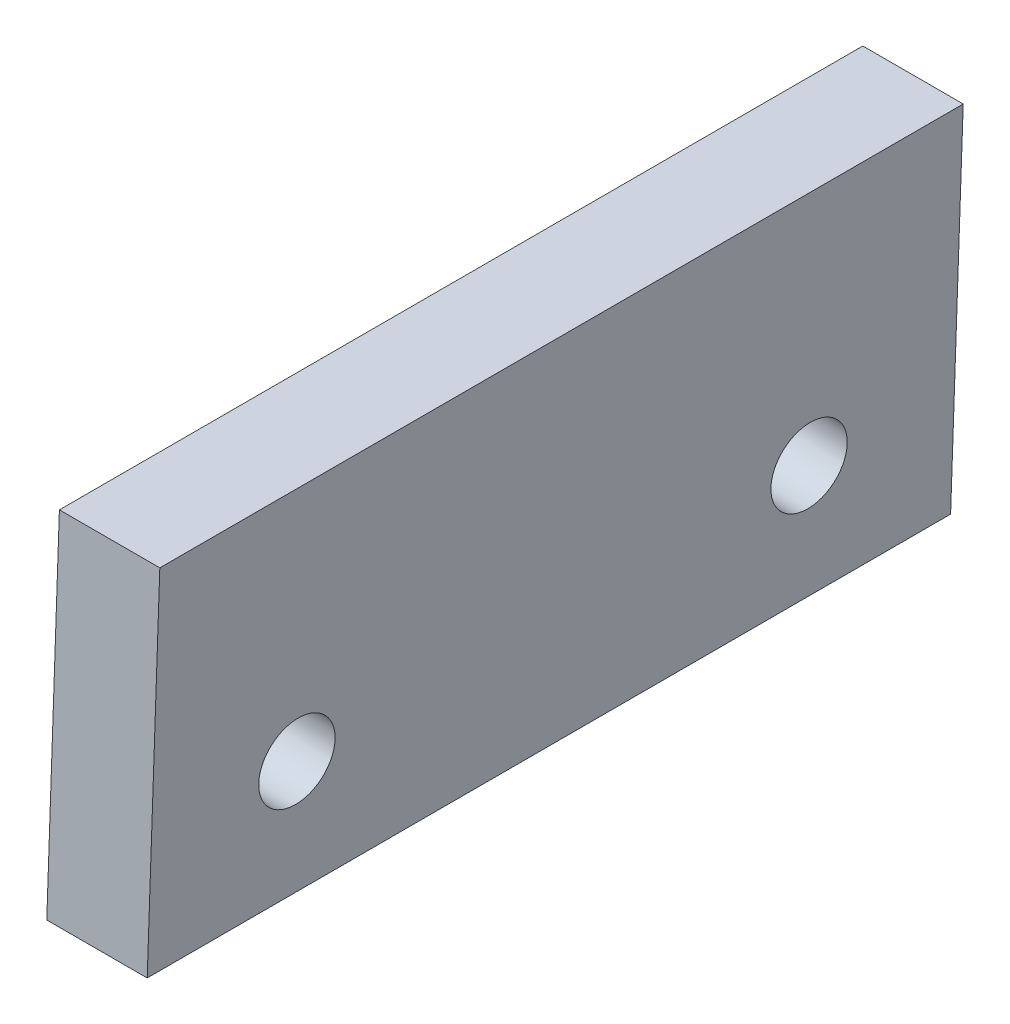
ISO-10303-21;
HEADER;
FILE_DESCRIPTION(('STEP AP214'),'2;1');
FILE_NAME('part.step','',(''),(''),'','','');
FILE_SCHEMA(('AUTOMOTIVE_DESIGN { 1 0 10303 214 1 1 1 1 }'));
ENDSEC;
DATA;
#1=APPLICATION_CONTEXT('core data for automotive mechanical design processes');
#2=APPLICATION_PROTOCOL_DEFINITION('international standard','automotive_design',2000,#1);
#3=PRODUCT_CONTEXT('',#1,'mechanical');
#4=PRODUCT('Part','Part','',(#3));
#5=PRODUCT_RELATED_PRODUCT_CATEGORY('part','',(#4));
#6=PRODUCT_DEFINITION_FORMATION('','',#4);
#7=PRODUCT_DEFINITION_CONTEXT('part definition',#1,'design');
#8=PRODUCT_DEFINITION('design','',#6,#7);
#9=PRODUCT_DEFINITION_SHAPE('','',#8);
#10=(LENGTH_UNIT() NAMED_UNIT(*) SI_UNIT(.MILLI.,.METRE.));
#11=(NAMED_UNIT(*) PLANE_ANGLE_UNIT() SI_UNIT($,.RADIAN.));
#12=(NAMED_UNIT(*) SI_UNIT($,.STERADIAN.) SOLID_ANGLE_UNIT());
#13=UNCERTAINTY_MEASURE_WITH_UNIT(LENGTH_MEASURE(1.E-05),#10,'distance_accuracy_value','');
#14=(GEOMETRIC_REPRESENTATION_CONTEXT(3) GLOBAL_UNCERTAINTY_ASSIGNED_CONTEXT((#13)) GLOBAL_UNIT_ASSIGNED_CONTEXT((#10,
#11,#12)) REPRESENTATION_CONTEXT('',''));
#15=CARTESIAN_POINT('',(0.,0.,0.));
#16=DIRECTION('',(0.,0.,1.));
#17=DIRECTION('',(1.,0.,0.));
#18=AXIS2_PLACEMENT_3D('',#15,#16,#17);
#19=CARTESIAN_POINT('',(0.,0.,20.));
#20=DIRECTION('',(0.999390827019096,-0.0348994967024969,0.));
#21=DIRECTION('',(0.0348994967024969,0.999390827019096,0.));
#22=AXIS2_PLACEMENT_3D('',#19,#20,#21);
#23=PLANE('',#22);
#24=CARTESIAN_POINT('',(0.104698490107491,2.99817248105729,3.625));
#25=DIRECTION('',(-0.999390827019096,0.0348994967024969,0.));
#26=DIRECTION('',(-0.0348994967024969,-0.999390827019096,0.));
#27=AXIS2_PLACEMENT_3D('',#24,#25,#26);
#28=CIRCLE('',#27,0.95);
#29=CARTESIAN_POINT('',(0.0715439682401187,2.04875119538915,3.625));
#30=VERTEX_POINT('',#29);
#31=EDGE_CURVE('E108',#30,#30,#28,.T.);
#32=ORIENTED_EDGE('',*,*,#31,.F.);
#33=EDGE_LOOP('',(#32));
#34=FACE_BOUND('',#33,.T.);
#35=CARTESIAN_POINT('',(0.104698490107491,2.99817248105729,16.375));
#36=DIRECTION('',(-0.999390827019096,0.0348994967024969,0.));
#37=DIRECTION('',(-0.0348994967024969,-0.999390827019096,0.));
#38=AXIS2_PLACEMENT_3D('',#35,#36,#37);
#39=CIRCLE('',#38,0.950000000000001);
#40=CARTESIAN_POINT('',(0.0715439682401186,2.04875119538915,16.375));
#41=VERTEX_POINT('',#40);
#42=EDGE_CURVE('E113',#41,#41,#39,.T.);
#43=ORIENTED_EDGE('',*,*,#42,.F.);
#44=EDGE_LOOP('',(#43));
#45=FACE_BOUND('',#44,.T.);
#46=DIRECTION('',(-0.0348994967024969,-0.999390827019096,0.));
#47=VECTOR('',#46,1.);
#48=CARTESIAN_POINT('',(0.,0.,0.));
#49=LINE('',#48,#47);
#50=CARTESIAN_POINT('',(0.314286925425693,9.,0.));
#51=VERTEX_POINT('',#50);
#52=CARTESIAN_POINT('',(0.,0.,0.));
#53=VERTEX_POINT('',#52);
#54=EDGE_CURVE('E99',#51,#53,#49,.T.);
#55=ORIENTED_EDGE('',*,*,#54,.T.);
#56=DIRECTION('',(0.,0.,-1.));
#57=VECTOR('',#56,1.);
#58=CARTESIAN_POINT('',(0.,0.,20.));
#59=LINE('',#58,#57);
#60=CARTESIAN_POINT('',(0.,0.,20.));
#61=VERTEX_POINT('',#60);
#62=EDGE_CURVE('E11',#61,#53,#59,.T.);
#63=ORIENTED_EDGE('',*,*,#62,.F.);
#64=DIRECTION('',(-0.0348994967024969,-0.999390827019096,0.));
#65=VECTOR('',#64,1.);
#66=CARTESIAN_POINT('',(0.,0.,20.));
#67=LINE('',#66,#65);
#68=CARTESIAN_POINT('',(0.314286925425693,9.,20.));
#69=VERTEX_POINT('',#68);
#70=EDGE_CURVE('E86',#69,#61,#67,.T.);
#71=ORIENTED_EDGE('',*,*,#70,.F.);
#72=DIRECTION('',(0.,0.,-1.));
#73=VECTOR('',#72,1.);
#74=CARTESIAN_POINT('',(0.314286925425693,9.,20.));
#75=LINE('',#74,#73);
#76=EDGE_CURVE('E95',#69,#51,#75,.T.);
#77=ORIENTED_EDGE('',*,*,#76,.T.);
#78=EDGE_LOOP('',(#55,#63,#71,#77));
#79=FACE_BOUND('',#78,.T.);
#80=ADVANCED_FACE('F33',(#34,#45,#79),#23,.F.);
#81=CARTESIAN_POINT('',(0.,0.,20.));
#82=DIRECTION('',(0.,1.,0.));
#83=DIRECTION('',(0.,0.,1.));
#84=AXIS2_PLACEMENT_3D('',#81,#82,#83);
#85=PLANE('',#84);
#86=DIRECTION('',(1.,0.,0.));
#87=VECTOR('',#86,1.);
#88=CARTESIAN_POINT('',(0.,0.,0.));
#89=LINE('',#88,#87);
#90=CARTESIAN_POINT('',(2.5,0.,0.));
#91=VERTEX_POINT('',#90);
#92=EDGE_CURVE('E90',#53,#91,#89,.T.);
#93=ORIENTED_EDGE('',*,*,#92,.T.);
#94=DIRECTION('',(0.,0.,-1.));
#95=VECTOR('',#94,1.);
#96=CARTESIAN_POINT('',(2.5,0.,20.));
#97=LINE('',#96,#95);
#98=CARTESIAN_POINT('',(2.5,0.,20.));
#99=VERTEX_POINT('',#98);
#100=EDGE_CURVE('E42',#99,#91,#97,.T.);
#101=ORIENTED_EDGE('',*,*,#100,.F.);
#102=DIRECTION('',(1.,0.,0.));
#103=VECTOR('',#102,1.);
#104=CARTESIAN_POINT('',(0.,0.,20.));
#105=LINE('',#104,#103);
#106=EDGE_CURVE('E81',#61,#99,#105,.T.);
#107=ORIENTED_EDGE('',*,*,#106,.F.);
#108=ORIENTED_EDGE('',*,*,#62,.T.);
#109=EDGE_LOOP('',(#93,#101,#107,#108));
#110=FACE_BOUND('',#109,.T.);
#111=ADVANCED_FACE('F89',(#110),#85,.F.);
#112=CARTESIAN_POINT('',(2.5,0.,20.));
#113=DIRECTION('',(-0.999390827019096,0.0348994967024969,0.));
#114=DIRECTION('',(-0.0348994967024969,-0.999390827019096,0.));
#115=AXIS2_PLACEMENT_3D('',#112,#113,#114);
#116=PLANE('',#115);
#117=CARTESIAN_POINT('',(2.60165355293227,2.91097688887714,3.625));
#118=DIRECTION('',(-0.999390827019096,0.0348994967024969,0.));
#119=DIRECTION('',(-0.0348994967024969,-0.999390827019096,0.));
#120=AXIS2_PLACEMENT_3D('',#117,#118,#119);
#121=CIRCLE('',#120,0.95);
#122=CARTESIAN_POINT('',(2.5684990310649,1.961555603209,3.625));
#123=VERTEX_POINT('',#122);
#124=EDGE_CURVE('E36',#123,#123,#121,.T.);
#125=ORIENTED_EDGE('',*,*,#124,.T.);
#126=EDGE_LOOP('',(#125));
#127=FACE_BOUND('',#126,.T.);
#128=CARTESIAN_POINT('',(2.60165355293227,2.91097688887714,16.375));
#129=DIRECTION('',(-0.999390827019096,0.0348994967024969,0.));
#130=DIRECTION('',(-0.0348994967024969,-0.999390827019096,0.));
#131=AXIS2_PLACEMENT_3D('',#128,#129,#130);
#132=CIRCLE('',#131,0.950000000000001);
#133=CARTESIAN_POINT('',(2.5684990310649,1.961555603209,16.375));
#134=VERTEX_POINT('',#133);
#135=EDGE_CURVE('E106',#134,#134,#132,.T.);
#136=ORIENTED_EDGE('',*,*,#135,.T.);
#137=EDGE_LOOP('',(#136));
#138=FACE_BOUND('',#137,.T.);
#139=DIRECTION('',(0.0348994967024969,0.999390827019096,0.));
#140=VECTOR('',#139,1.);
#141=CARTESIAN_POINT('',(2.5,0.,0.));
#142=LINE('',#141,#140);
#143=CARTESIAN_POINT('',(2.81428692542569,9.,0.));
#144=VERTEX_POINT('',#143);
#145=EDGE_CURVE('E68',#91,#144,#142,.T.);
#146=ORIENTED_EDGE('',*,*,#145,.T.);
#147=DIRECTION('',(0.,0.,-1.));
#148=VECTOR('',#147,1.);
#149=CARTESIAN_POINT('',(2.81428692542569,9.,20.));
#150=LINE('',#149,#148);
#151=CARTESIAN_POINT('',(2.81428692542569,9.,20.));
#152=VERTEX_POINT('',#151);
#153=EDGE_CURVE('E91',#152,#144,#150,.T.);
#154=ORIENTED_EDGE('',*,*,#153,.F.);
#155=DIRECTION('',(0.0348994967024969,0.999390827019096,0.));
#156=VECTOR('',#155,1.);
#157=CARTESIAN_POINT('',(2.5,0.,20.));
#158=LINE('',#157,#156);
#159=EDGE_CURVE('E84',#99,#152,#158,.T.);
#160=ORIENTED_EDGE('',*,*,#159,.F.);
#161=ORIENTED_EDGE('',*,*,#100,.T.);
#162=EDGE_LOOP('',(#146,#154,#160,#161));
#163=FACE_BOUND('',#162,.T.);
#164=ADVANCED_FACE('F93',(#127,#138,#163),#116,.F.);
#165=CARTESIAN_POINT('',(2.81428692542569,9.,20.));
#166=DIRECTION('',(0.,-1.,0.));
#167=DIRECTION('',(0.,0.,-1.));
#168=AXIS2_PLACEMENT_3D('',#165,#166,#167);
#169=PLANE('',#168);
#170=DIRECTION('',(-1.,0.,0.));
#171=VECTOR('',#170,1.);
#172=CARTESIAN_POINT('',(2.81428692542569,9.,0.));
#173=LINE('',#172,#171);
#174=EDGE_CURVE('E74',#144,#51,#173,.T.);
#175=ORIENTED_EDGE('',*,*,#174,.T.);
#176=ORIENTED_EDGE('',*,*,#76,.F.);
#177=DIRECTION('',(-1.,0.,0.));
#178=VECTOR('',#177,1.);
#179=CARTESIAN_POINT('',(2.81428692542569,9.,20.));
#180=LINE('',#179,#178);
#181=EDGE_CURVE('E51',#152,#69,#180,.T.);
#182=ORIENTED_EDGE('',*,*,#181,.F.);
#183=ORIENTED_EDGE('',*,*,#153,.T.);
#184=EDGE_LOOP('',(#175,#176,#182,#183));
#185=FACE_BOUND('',#184,.T.);
#186=ADVANCED_FACE('F138',(#185),#169,.F.);
#187=CARTESIAN_POINT('',(0.,0.,20.));
#188=DIRECTION('',(0.,0.,1.));
#189=DIRECTION('',(1.,0.,0.));
#190=AXIS2_PLACEMENT_3D('',#187,#188,#189);
#191=PLANE('',#190);
#192=ORIENTED_EDGE('',*,*,#70,.T.);
#193=ORIENTED_EDGE('',*,*,#106,.T.);
#194=ORIENTED_EDGE('',*,*,#159,.T.);
#195=ORIENTED_EDGE('',*,*,#181,.T.);
#196=EDGE_LOOP('',(#192,#193,#194,#195));
#197=FACE_BOUND('',#196,.T.);
#198=ADVANCED_FACE('F82',(#197),#191,.T.);
#199=CARTESIAN_POINT('',(0.,0.,0.));
#200=DIRECTION('',(0.,0.,1.));
#201=DIRECTION('',(1.,0.,0.));
#202=AXIS2_PLACEMENT_3D('',#199,#200,#201);
#203=PLANE('',#202);
#204=ORIENTED_EDGE('',*,*,#54,.F.);
#205=ORIENTED_EDGE('',*,*,#174,.F.);
#206=ORIENTED_EDGE('',*,*,#145,.F.);
#207=ORIENTED_EDGE('',*,*,#92,.F.);
#208=EDGE_LOOP('',(#204,#205,#206,#207));
#209=FACE_BOUND('',#208,.T.);
#210=ADVANCED_FACE('F129',(#209),#203,.F.);
#211=CARTESIAN_POINT('',(2.9155576847808,2.90001511504635,16.375));
#212=DIRECTION('',(-0.999390827019096,0.0348994967024969,0.));
#213=DIRECTION('',(-0.0348994967024969,-0.999390827019096,0.));
#214=AXIS2_PLACEMENT_3D('',#211,#212,#213);
#215=CYLINDRICAL_SURFACE('',#214,0.950000000000001);
#216=ORIENTED_EDGE('',*,*,#42,.T.);
#217=EDGE_LOOP('',(#216));
#218=FACE_BOUND('',#217,.T.);
#219=ORIENTED_EDGE('',*,*,#135,.F.);
#220=EDGE_LOOP('',(#219));
#221=FACE_BOUND('',#220,.T.);
#222=ADVANCED_FACE('F121',(#218,#221),#215,.F.);
#223=CARTESIAN_POINT('',(2.9155576847808,2.90001511504635,3.625));
#224=DIRECTION('',(-0.999390827019096,0.0348994967024969,0.));
#225=DIRECTION('',(-0.0348994967024969,-0.999390827019096,0.));
#226=AXIS2_PLACEMENT_3D('',#223,#224,#225);
#227=CYLINDRICAL_SURFACE('',#226,0.95);
#228=ORIENTED_EDGE('',*,*,#31,.T.);
#229=EDGE_LOOP('',(#228));
#230=FACE_BOUND('',#229,.T.);
#231=ORIENTED_EDGE('',*,*,#124,.F.);
#232=EDGE_LOOP('',(#231));
#233=FACE_BOUND('',#232,.T.);
#234=ADVANCED_FACE('F136',(#230,#233),#227,.F.);
#235=CLOSED_SHELL('',(#80,#111,#164,#186,#198,#210,#222,#234));
#236=MANIFOLD_SOLID_BREP('B2',#235);
#237=ADVANCED_BREP_SHAPE_REPRESENTATION('',(#18,#236),#14);
#238=SHAPE_DEFINITION_REPRESENTATION(#9,#237);
ENDSEC;
END-ISO-10303-21;
